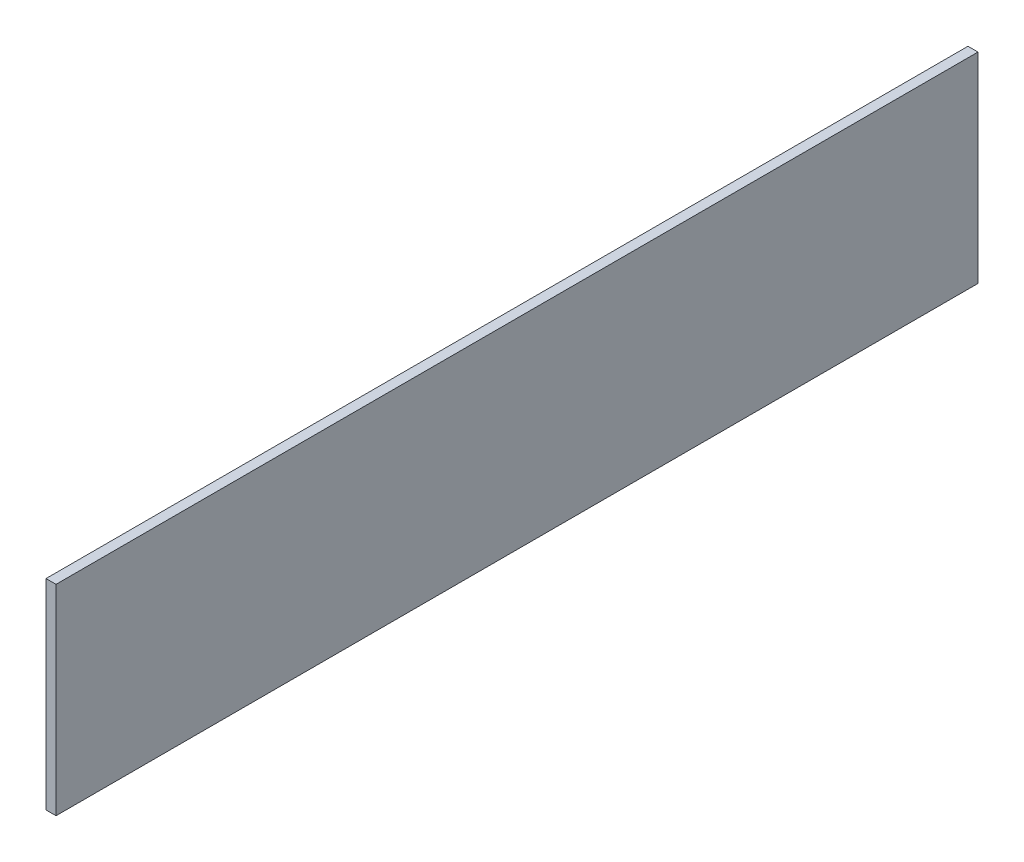
ISO-10303-21;
HEADER;
FILE_DESCRIPTION(('STEP AP214'),'2;1');
FILE_NAME('part.step','',(''),(''),'','','');
FILE_SCHEMA(('AUTOMOTIVE_DESIGN { 1 0 10303 214 1 1 1 1 }'));
ENDSEC;
DATA;
#1=APPLICATION_CONTEXT('core data for automotive mechanical design processes');
#2=APPLICATION_PROTOCOL_DEFINITION('international standard','automotive_design',2000,#1);
#3=PRODUCT_CONTEXT('',#1,'mechanical');
#4=PRODUCT('Part','Part','',(#3));
#5=PRODUCT_RELATED_PRODUCT_CATEGORY('part','',(#4));
#6=PRODUCT_DEFINITION_FORMATION('','',#4);
#7=PRODUCT_DEFINITION_CONTEXT('part definition',#1,'design');
#8=PRODUCT_DEFINITION('design','',#6,#7);
#9=PRODUCT_DEFINITION_SHAPE('','',#8);
#10=(LENGTH_UNIT() NAMED_UNIT(*) SI_UNIT(.MILLI.,.METRE.));
#11=(NAMED_UNIT(*) PLANE_ANGLE_UNIT() SI_UNIT($,.RADIAN.));
#12=(NAMED_UNIT(*) SI_UNIT($,.STERADIAN.) SOLID_ANGLE_UNIT());
#13=UNCERTAINTY_MEASURE_WITH_UNIT(LENGTH_MEASURE(1.E-05),#10,'distance_accuracy_value','');
#14=(GEOMETRIC_REPRESENTATION_CONTEXT(3) GLOBAL_UNCERTAINTY_ASSIGNED_CONTEXT((#13)) GLOBAL_UNIT_ASSIGNED_CONTEXT((#10,
#11,#12)) REPRESENTATION_CONTEXT('',''));
#15=CARTESIAN_POINT('',(0.,0.,0.));
#16=DIRECTION('',(0.,0.,1.));
#17=DIRECTION('',(1.,0.,0.));
#18=AXIS2_PLACEMENT_3D('',#15,#16,#17);
#19=CARTESIAN_POINT('',(25.,0.,0.));
#20=DIRECTION('',(0.,0.,-1.));
#21=DIRECTION('',(-1.,0.,0.));
#22=AXIS2_PLACEMENT_3D('',#19,#20,#21);
#23=PLANE('',#22);
#24=DIRECTION('',(0.,-1.,0.));
#25=VECTOR('',#24,1.);
#26=CARTESIAN_POINT('',(0.,0.,0.));
#27=LINE('',#26,#25);
#28=CARTESIAN_POINT('',(0.,500.,0.));
#29=VERTEX_POINT('',#28);
#30=CARTESIAN_POINT('',(0.,0.,0.));
#31=VERTEX_POINT('',#30);
#32=EDGE_CURVE('E107',#29,#31,#27,.T.);
#33=ORIENTED_EDGE('',*,*,#32,.T.);
#34=DIRECTION('',(-1.,0.,0.));
#35=VECTOR('',#34,1.);
#36=CARTESIAN_POINT('',(25.,0.,0.));
#37=LINE('',#36,#35);
#38=CARTESIAN_POINT('',(25.,0.,0.));
#39=VERTEX_POINT('',#38);
#40=EDGE_CURVE('E11',#39,#31,#37,.T.);
#41=ORIENTED_EDGE('',*,*,#40,.F.);
#42=DIRECTION('',(0.,-1.,0.));
#43=VECTOR('',#42,1.);
#44=CARTESIAN_POINT('',(25.,0.,0.));
#45=LINE('',#44,#43);
#46=CARTESIAN_POINT('',(25.,500.,0.));
#47=VERTEX_POINT('',#46);
#48=EDGE_CURVE('E91',#47,#39,#45,.T.);
#49=ORIENTED_EDGE('',*,*,#48,.F.);
#50=DIRECTION('',(-1.,0.,0.));
#51=VECTOR('',#50,1.);
#52=CARTESIAN_POINT('',(25.,500.,0.));
#53=LINE('',#52,#51);
#54=EDGE_CURVE('E103',#47,#29,#53,.T.);
#55=ORIENTED_EDGE('',*,*,#54,.T.);
#56=EDGE_LOOP('',(#33,#41,#49,#55));
#57=FACE_BOUND('',#56,.T.);
#58=ADVANCED_FACE('F39',(#57),#23,.F.);
#59=CARTESIAN_POINT('',(25.,0.,0.));
#60=DIRECTION('',(0.,1.,0.));
#61=DIRECTION('',(0.,0.,1.));
#62=AXIS2_PLACEMENT_3D('',#59,#60,#61);
#63=PLANE('',#62);
#64=DIRECTION('',(0.,0.,-1.));
#65=VECTOR('',#64,1.);
#66=CARTESIAN_POINT('',(0.,0.,0.));
#67=LINE('',#66,#65);
#68=CARTESIAN_POINT('',(0.,0.,-2300.));
#69=VERTEX_POINT('',#68);
#70=EDGE_CURVE('E96',#31,#69,#67,.T.);
#71=ORIENTED_EDGE('',*,*,#70,.T.);
#72=DIRECTION('',(-1.,0.,0.));
#73=VECTOR('',#72,1.);
#74=CARTESIAN_POINT('',(25.,0.,-2300.));
#75=LINE('',#74,#73);
#76=CARTESIAN_POINT('',(25.,0.,-2300.));
#77=VERTEX_POINT('',#76);
#78=EDGE_CURVE('E48',#77,#69,#75,.T.);
#79=ORIENTED_EDGE('',*,*,#78,.F.);
#80=DIRECTION('',(0.,0.,-1.));
#81=VECTOR('',#80,1.);
#82=CARTESIAN_POINT('',(25.,0.,0.));
#83=LINE('',#82,#81);
#84=EDGE_CURVE('E86',#39,#77,#83,.T.);
#85=ORIENTED_EDGE('',*,*,#84,.F.);
#86=ORIENTED_EDGE('',*,*,#40,.T.);
#87=EDGE_LOOP('',(#71,#79,#85,#86));
#88=FACE_BOUND('',#87,.T.);
#89=ADVANCED_FACE('F95',(#88),#63,.F.);
#90=CARTESIAN_POINT('',(25.,0.,-2300.));
#91=DIRECTION('',(0.,0.,1.));
#92=DIRECTION('',(1.,0.,0.));
#93=AXIS2_PLACEMENT_3D('',#90,#91,#92);
#94=PLANE('',#93);
#95=DIRECTION('',(0.,1.,0.));
#96=VECTOR('',#95,1.);
#97=CARTESIAN_POINT('',(0.,0.,-2300.));
#98=LINE('',#97,#96);
#99=CARTESIAN_POINT('',(0.,500.,-2300.));
#100=VERTEX_POINT('',#99);
#101=EDGE_CURVE('E73',#69,#100,#98,.T.);
#102=ORIENTED_EDGE('',*,*,#101,.T.);
#103=DIRECTION('',(-1.,0.,0.));
#104=VECTOR('',#103,1.);
#105=CARTESIAN_POINT('',(25.,500.,-2300.));
#106=LINE('',#105,#104);
#107=CARTESIAN_POINT('',(25.,500.,-2300.));
#108=VERTEX_POINT('',#107);
#109=EDGE_CURVE('E98',#108,#100,#106,.T.);
#110=ORIENTED_EDGE('',*,*,#109,.F.);
#111=DIRECTION('',(0.,1.,0.));
#112=VECTOR('',#111,1.);
#113=CARTESIAN_POINT('',(25.,0.,-2300.));
#114=LINE('',#113,#112);
#115=EDGE_CURVE('E89',#77,#108,#114,.T.);
#116=ORIENTED_EDGE('',*,*,#115,.F.);
#117=ORIENTED_EDGE('',*,*,#78,.T.);
#118=EDGE_LOOP('',(#102,#110,#116,#117));
#119=FACE_BOUND('',#118,.T.);
#120=ADVANCED_FACE('F99',(#119),#94,.F.);
#121=CARTESIAN_POINT('',(25.,500.,0.));
#122=DIRECTION('',(0.,-1.,0.));
#123=DIRECTION('',(0.,0.,-1.));
#124=AXIS2_PLACEMENT_3D('',#121,#122,#123);
#125=PLANE('',#124);
#126=DIRECTION('',(0.,0.,1.));
#127=VECTOR('',#126,1.);
#128=CARTESIAN_POINT('',(0.,500.,0.));
#129=LINE('',#128,#127);
#130=EDGE_CURVE('E79',#100,#29,#129,.T.);
#131=ORIENTED_EDGE('',*,*,#130,.T.);
#132=ORIENTED_EDGE('',*,*,#54,.F.);
#133=DIRECTION('',(0.,0.,1.));
#134=VECTOR('',#133,1.);
#135=CARTESIAN_POINT('',(25.,500.,0.));
#136=LINE('',#135,#134);
#137=EDGE_CURVE('E56',#108,#47,#136,.T.);
#138=ORIENTED_EDGE('',*,*,#137,.F.);
#139=ORIENTED_EDGE('',*,*,#109,.T.);
#140=EDGE_LOOP('',(#131,#132,#138,#139));
#141=FACE_BOUND('',#140,.T.);
#142=ADVANCED_FACE('F120',(#141),#125,.F.);
#143=CARTESIAN_POINT('',(25.,0.,0.));
#144=DIRECTION('',(-1.,0.,0.));
#145=DIRECTION('',(0.,0.,1.));
#146=AXIS2_PLACEMENT_3D('',#143,#144,#145);
#147=PLANE('',#146);
#148=ORIENTED_EDGE('',*,*,#48,.T.);
#149=ORIENTED_EDGE('',*,*,#84,.T.);
#150=ORIENTED_EDGE('',*,*,#115,.T.);
#151=ORIENTED_EDGE('',*,*,#137,.T.);
#152=EDGE_LOOP('',(#148,#149,#150,#151));
#153=FACE_BOUND('',#152,.T.);
#154=ADVANCED_FACE('F87',(#153),#147,.F.);
#155=CARTESIAN_POINT('',(0.,0.,0.));
#156=DIRECTION('',(-1.,0.,0.));
#157=DIRECTION('',(0.,0.,1.));
#158=AXIS2_PLACEMENT_3D('',#155,#156,#157);
#159=PLANE('',#158);
#160=ORIENTED_EDGE('',*,*,#32,.F.);
#161=ORIENTED_EDGE('',*,*,#130,.F.);
#162=ORIENTED_EDGE('',*,*,#101,.F.);
#163=ORIENTED_EDGE('',*,*,#70,.F.);
#164=EDGE_LOOP('',(#160,#161,#162,#163));
#165=FACE_BOUND('',#164,.T.);
#166=ADVANCED_FACE('F123',(#165),#159,.T.);
#167=CLOSED_SHELL('',(#58,#89,#120,#142,#154,#166));
#168=MANIFOLD_SOLID_BREP('B2',#167);
#169=ADVANCED_BREP_SHAPE_REPRESENTATION('',(#18,#168),#14);
#170=SHAPE_DEFINITION_REPRESENTATION(#9,#169);
ENDSEC;
END-ISO-10303-21;
